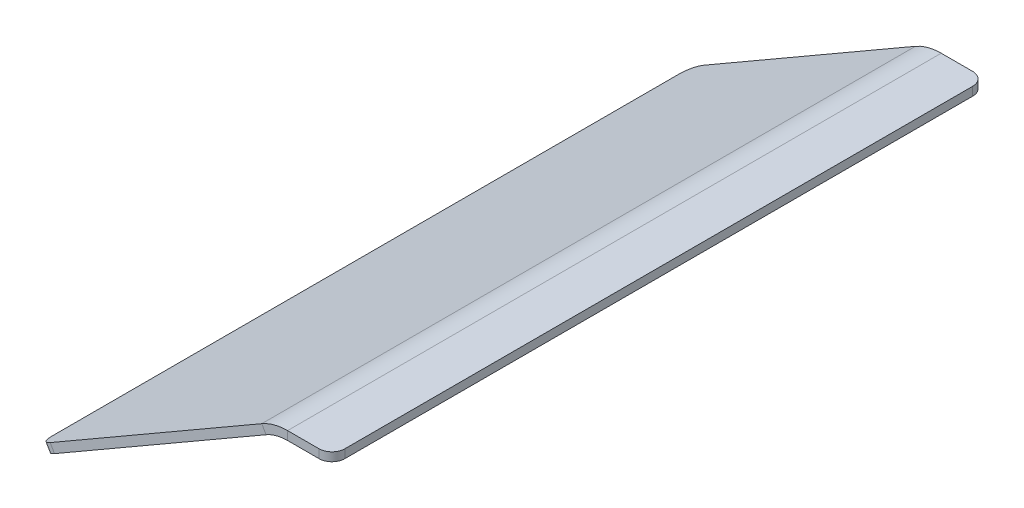
ISO-10303-21;
HEADER;
FILE_DESCRIPTION(('STEP AP214'),'2;1');
FILE_NAME('part.step','',(''),(''),'','','');
FILE_SCHEMA(('AUTOMOTIVE_DESIGN { 1 0 10303 214 1 1 1 1 }'));
ENDSEC;
DATA;
#1=APPLICATION_CONTEXT('core data for automotive mechanical design processes');
#2=APPLICATION_PROTOCOL_DEFINITION('international standard','automotive_design',2000,#1);
#3=PRODUCT_CONTEXT('',#1,'mechanical');
#4=PRODUCT('Part','Part','',(#3));
#5=PRODUCT_RELATED_PRODUCT_CATEGORY('part','',(#4));
#6=PRODUCT_DEFINITION_FORMATION('','',#4);
#7=PRODUCT_DEFINITION_CONTEXT('part definition',#1,'design');
#8=PRODUCT_DEFINITION('design','',#6,#7);
#9=PRODUCT_DEFINITION_SHAPE('','',#8);
#10=(LENGTH_UNIT() NAMED_UNIT(*) SI_UNIT(.MILLI.,.METRE.));
#11=(NAMED_UNIT(*) PLANE_ANGLE_UNIT() SI_UNIT($,.RADIAN.));
#12=(NAMED_UNIT(*) SI_UNIT($,.STERADIAN.) SOLID_ANGLE_UNIT());
#13=UNCERTAINTY_MEASURE_WITH_UNIT(LENGTH_MEASURE(1.E-05),#10,'distance_accuracy_value','');
#14=(GEOMETRIC_REPRESENTATION_CONTEXT(3) GLOBAL_UNCERTAINTY_ASSIGNED_CONTEXT((#13)) GLOBAL_UNIT_ASSIGNED_CONTEXT((#10,
#11,#12)) REPRESENTATION_CONTEXT('',''));
#15=CARTESIAN_POINT('',(0.,0.,0.));
#16=DIRECTION('',(0.,0.,1.));
#17=DIRECTION('',(1.,0.,0.));
#18=AXIS2_PLACEMENT_3D('',#15,#16,#17);
#19=CARTESIAN_POINT('',(-3.32050807568874,0.392304845413293,0.));
#20=DIRECTION('',(0.,0.,-1.));
#21=DIRECTION('',(-1.,0.,0.));
#22=AXIS2_PLACEMENT_3D('',#19,#20,#21);
#23=PLANE('',#22);
#24=DIRECTION('',(1.,0.,0.));
#25=VECTOR('',#24,1.);
#26=CARTESIAN_POINT('',(2.67949192431119,2.,0.));
#27=LINE('',#26,#25);
#28=CARTESIAN_POINT('',(10.,2.,0.));
#29=VERTEX_POINT('',#28);
#30=CARTESIAN_POINT('',(2.67949192431119,2.,0.));
#31=VERTEX_POINT('',#30);
#32=EDGE_CURVE('E167',#29,#31,#27,.F.);
#33=ORIENTED_EDGE('',*,*,#32,.F.);
#34=DIRECTION('',(0.,-1.,0.));
#35=VECTOR('',#34,1.);
#36=CARTESIAN_POINT('',(10.,0.392304845413294,0.));
#37=LINE('',#36,#35);
#38=CARTESIAN_POINT('',(10.,0.,0.));
#39=VERTEX_POINT('',#38);
#40=EDGE_CURVE('E186',#29,#39,#37,.T.);
#41=ORIENTED_EDGE('',*,*,#40,.T.);
#42=DIRECTION('',(-1.,0.,0.));
#43=VECTOR('',#42,1.);
#44=CARTESIAN_POINT('',(2.67949192431119,0.,0.));
#45=LINE('',#44,#43);
#46=CARTESIAN_POINT('',(2.67949192431119,0.,0.));
#47=VERTEX_POINT('',#46);
#48=EDGE_CURVE('E195',#39,#47,#45,.T.);
#49=ORIENTED_EDGE('',*,*,#48,.T.);
#50=DIRECTION('',(0.,1.,0.));
#51=VECTOR('',#50,1.);
#52=CARTESIAN_POINT('',(2.67949192431119,0.,0.));
#53=LINE('',#52,#51);
#54=EDGE_CURVE('E13',#47,#31,#53,.T.);
#55=ORIENTED_EDGE('',*,*,#54,.T.);
#56=EDGE_LOOP('',(#33,#41,#49,#55));
#57=FACE_BOUND('',#56,.T.);
#58=ADVANCED_FACE('F48',(#57),#23,.T.);
#59=CARTESIAN_POINT('',(2.67949192431119,0.,152.));
#60=DIRECTION('',(0.,-1.,0.));
#61=DIRECTION('',(0.,0.,-1.));
#62=AXIS2_PLACEMENT_3D('',#59,#60,#61);
#63=PLANE('',#62);
#64=DIRECTION('',(0.,0.,-1.));
#65=VECTOR('',#64,1.);
#66=CARTESIAN_POINT('',(13.,0.,152.));
#67=LINE('',#66,#65);
#68=CARTESIAN_POINT('',(13.,0.,149.));
#69=VERTEX_POINT('',#68);
#70=CARTESIAN_POINT('',(13.,0.,3.));
#71=VERTEX_POINT('',#70);
#72=EDGE_CURVE('E189',#69,#71,#67,.T.);
#73=ORIENTED_EDGE('',*,*,#72,.F.);
#74=CARTESIAN_POINT('',(10.,0.,149.));
#75=DIRECTION('',(0.,-1.,0.));
#76=DIRECTION('',(0.,0.,-1.));
#77=AXIS2_PLACEMENT_3D('',#74,#75,#76);
#78=CIRCLE('',#77,3.);
#79=CARTESIAN_POINT('',(10.,0.,152.));
#80=VERTEX_POINT('',#79);
#81=EDGE_CURVE('E165',#69,#80,#78,.T.);
#82=ORIENTED_EDGE('',*,*,#81,.T.);
#83=DIRECTION('',(-1.,0.,0.));
#84=VECTOR('',#83,1.);
#85=CARTESIAN_POINT('',(2.67949192431119,0.,152.));
#86=LINE('',#85,#84);
#87=CARTESIAN_POINT('',(2.6794919243112,0.,152.));
#88=VERTEX_POINT('',#87);
#89=EDGE_CURVE('E162',#80,#88,#86,.T.);
#90=ORIENTED_EDGE('',*,*,#89,.T.);
#91=DIRECTION('',(0.,0.,-1.));
#92=VECTOR('',#91,1.);
#93=CARTESIAN_POINT('',(2.67949192431119,0.,152.));
#94=LINE('',#93,#92);
#95=EDGE_CURVE('E153',#88,#47,#94,.T.);
#96=ORIENTED_EDGE('',*,*,#95,.T.);
#97=ORIENTED_EDGE('',*,*,#48,.F.);
#98=CARTESIAN_POINT('',(10.,0.,3.));
#99=DIRECTION('',(0.,-1.,0.));
#100=DIRECTION('',(0.,0.,-1.));
#101=AXIS2_PLACEMENT_3D('',#98,#99,#100);
#102=CIRCLE('',#101,3.);
#103=EDGE_CURVE('E183',#39,#71,#102,.T.);
#104=ORIENTED_EDGE('',*,*,#103,.T.);
#105=EDGE_LOOP('',(#73,#82,#90,#96,#97,#104));
#106=FACE_BOUND('',#105,.T.);
#107=ADVANCED_FACE('F164',(#106),#63,.T.);
#108=CARTESIAN_POINT('',(13.,2.,152.));
#109=DIRECTION('',(1.,0.,0.));
#110=DIRECTION('',(0.,0.,-1.));
#111=AXIS2_PLACEMENT_3D('',#108,#109,#110);
#112=PLANE('',#111);
#113=DIRECTION('',(0.,0.,-1.));
#114=VECTOR('',#113,1.);
#115=CARTESIAN_POINT('',(13.,2.,152.));
#116=LINE('',#115,#114);
#117=CARTESIAN_POINT('',(13.,2.,149.));
#118=VERTEX_POINT('',#117);
#119=CARTESIAN_POINT('',(13.,2.,3.));
#120=VERTEX_POINT('',#119);
#121=EDGE_CURVE('E191',#118,#120,#116,.T.);
#122=ORIENTED_EDGE('',*,*,#121,.F.);
#123=DIRECTION('',(0.,-1.,0.));
#124=VECTOR('',#123,1.);
#125=CARTESIAN_POINT('',(13.,2.,149.));
#126=LINE('',#125,#124);
#127=EDGE_CURVE('E175',#118,#69,#126,.T.);
#128=ORIENTED_EDGE('',*,*,#127,.T.);
#129=ORIENTED_EDGE('',*,*,#72,.T.);
#130=DIRECTION('',(0.,-1.,0.));
#131=VECTOR('',#130,1.);
#132=CARTESIAN_POINT('',(13.,2.,3.));
#133=LINE('',#132,#131);
#134=EDGE_CURVE('E180',#71,#120,#133,.F.);
#135=ORIENTED_EDGE('',*,*,#134,.T.);
#136=EDGE_LOOP('',(#122,#128,#129,#135));
#137=FACE_BOUND('',#136,.T.);
#138=ADVANCED_FACE('F261',(#137),#112,.T.);
#139=CARTESIAN_POINT('',(2.67949192431119,2.,152.));
#140=DIRECTION('',(0.,-1.,0.));
#141=DIRECTION('',(0.,0.,-1.));
#142=AXIS2_PLACEMENT_3D('',#139,#140,#141);
#143=PLANE('',#142);
#144=DIRECTION('',(1.,0.,0.));
#145=VECTOR('',#144,1.);
#146=CARTESIAN_POINT('',(2.67949192431119,2.,152.));
#147=LINE('',#146,#145);
#148=CARTESIAN_POINT('',(10.,2.,152.));
#149=VERTEX_POINT('',#148);
#150=CARTESIAN_POINT('',(2.6794919243112,2.,152.));
#151=VERTEX_POINT('',#150);
#152=EDGE_CURVE('E166',#149,#151,#147,.F.);
#153=ORIENTED_EDGE('',*,*,#152,.F.);
#154=CARTESIAN_POINT('',(10.,2.,149.));
#155=DIRECTION('',(0.,-1.,0.));
#156=DIRECTION('',(0.,0.,-1.));
#157=AXIS2_PLACEMENT_3D('',#154,#155,#156);
#158=CIRCLE('',#157,3.);
#159=EDGE_CURVE('E160',#149,#118,#158,.F.);
#160=ORIENTED_EDGE('',*,*,#159,.T.);
#161=ORIENTED_EDGE('',*,*,#121,.T.);
#162=CARTESIAN_POINT('',(10.,2.,3.));
#163=DIRECTION('',(0.,-1.,0.));
#164=DIRECTION('',(0.,0.,-1.));
#165=AXIS2_PLACEMENT_3D('',#162,#163,#164);
#166=CIRCLE('',#165,3.);
#167=EDGE_CURVE('E178',#120,#29,#166,.F.);
#168=ORIENTED_EDGE('',*,*,#167,.T.);
#169=ORIENTED_EDGE('',*,*,#32,.T.);
#170=DIRECTION('',(0.,0.,-1.));
#171=VECTOR('',#170,1.);
#172=CARTESIAN_POINT('',(2.67949192431119,1.99999999999999,152.));
#173=LINE('',#172,#171);
#174=EDGE_CURVE('E56',#151,#31,#173,.T.);
#175=ORIENTED_EDGE('',*,*,#174,.F.);
#176=EDGE_LOOP('',(#153,#160,#161,#168,#169,#175));
#177=FACE_BOUND('',#176,.T.);
#178=ADVANCED_FACE('F252',(#177),#143,.F.);
#179=CARTESIAN_POINT('',(2.67949192431119,-10.,152.));
#180=DIRECTION('',(0.,0.,1.));
#181=DIRECTION('',(1.,0.,0.));
#182=AXIS2_PLACEMENT_3D('',#179,#180,#181);
#183=PLANE('',#182);
#184=ORIENTED_EDGE('',*,*,#89,.F.);
#185=DIRECTION('',(0.,-1.,0.));
#186=VECTOR('',#185,1.);
#187=CARTESIAN_POINT('',(10.,-10.,152.));
#188=LINE('',#187,#186);
#189=EDGE_CURVE('E70',#80,#149,#188,.F.);
#190=ORIENTED_EDGE('',*,*,#189,.T.);
#191=ORIENTED_EDGE('',*,*,#152,.T.);
#192=DIRECTION('',(0.,-1.,0.));
#193=VECTOR('',#192,1.);
#194=CARTESIAN_POINT('',(2.67949192431119,1.99999999999999,152.));
#195=LINE('',#194,#193);
#196=EDGE_CURVE('E143',#151,#88,#195,.T.);
#197=ORIENTED_EDGE('',*,*,#196,.T.);
#198=EDGE_LOOP('',(#184,#190,#191,#197));
#199=FACE_BOUND('',#198,.T.);
#200=ADVANCED_FACE('F169',(#199),#183,.T.);
#201=CARTESIAN_POINT('',(10.,0.392304845413294,3.));
#202=DIRECTION('',(0.,-1.,0.));
#203=DIRECTION('',(0.,0.,-1.));
#204=AXIS2_PLACEMENT_3D('',#201,#202,#203);
#205=CYLINDRICAL_SURFACE('',#204,3.);
#206=ORIENTED_EDGE('',*,*,#167,.F.);
#207=ORIENTED_EDGE('',*,*,#134,.F.);
#208=ORIENTED_EDGE('',*,*,#103,.F.);
#209=ORIENTED_EDGE('',*,*,#40,.F.);
#210=EDGE_LOOP('',(#206,#207,#208,#209));
#211=FACE_BOUND('',#210,.T.);
#212=ADVANCED_FACE('F258',(#211),#205,.T.);
#213=CARTESIAN_POINT('',(10.,2.,149.));
#214=DIRECTION('',(0.,-1.,0.));
#215=DIRECTION('',(0.,0.,-1.));
#216=AXIS2_PLACEMENT_3D('',#213,#214,#215);
#217=CYLINDRICAL_SURFACE('',#216,3.);
#218=ORIENTED_EDGE('',*,*,#159,.F.);
#219=ORIENTED_EDGE('',*,*,#189,.F.);
#220=ORIENTED_EDGE('',*,*,#81,.F.);
#221=ORIENTED_EDGE('',*,*,#127,.F.);
#222=EDGE_LOOP('',(#218,#219,#220,#221));
#223=FACE_BOUND('',#222,.T.);
#224=ADVANCED_FACE('F50',(#223),#217,.T.);
#225=CARTESIAN_POINT('',(-51.5285115251743,-29.7499999999997,149.));
#226=DIRECTION('',(-0.499999999999999,0.866025403784439,0.));
#227=DIRECTION('',(-0.866025403784439,-0.499999999999999,0.));
#228=AXIS2_PLACEMENT_3D('',#225,#226,#227);
#229=CYLINDRICAL_SURFACE('',#228,3.);
#230=CARTESIAN_POINT('',(-51.5285115251743,-29.7499999999997,149.));
#231=DIRECTION('',(0.499999999999995,-0.866025403784442,0.));
#232=DIRECTION('',(0.866025403784442,0.499999999999995,0.));
#233=AXIS2_PLACEMENT_3D('',#230,#231,#232);
#234=CIRCLE('',#233,3.);
#235=CARTESIAN_POINT('',(-51.5285115251743,-29.7499999999997,152.));
#236=VERTEX_POINT('',#235);
#237=CARTESIAN_POINT('',(-54.1265877365276,-31.2499999999997,149.));
#238=VERTEX_POINT('',#237);
#239=EDGE_CURVE('E217',#236,#238,#234,.T.);
#240=ORIENTED_EDGE('',*,*,#239,.F.);
#241=DIRECTION('',(-0.499999999999999,0.866025403784439,0.));
#242=VECTOR('',#241,1.);
#243=CARTESIAN_POINT('',(-51.7246639478808,-29.4102540378443,152.));
#244=LINE('',#243,#242);
#245=CARTESIAN_POINT('',(-52.5285115251743,-28.0179491924308,152.));
#246=VERTEX_POINT('',#245);
#247=EDGE_CURVE('E222',#246,#236,#244,.F.);
#248=ORIENTED_EDGE('',*,*,#247,.F.);
#249=CARTESIAN_POINT('',(-52.5285115251743,-28.0179491924308,149.));
#250=DIRECTION('',(0.499999999999995,-0.866025403784442,0.));
#251=DIRECTION('',(0.866025403784442,0.499999999999995,0.));
#252=AXIS2_PLACEMENT_3D('',#249,#250,#251);
#253=CIRCLE('',#252,3.);
#254=CARTESIAN_POINT('',(-55.1265877365276,-29.5179491924308,149.));
#255=VERTEX_POINT('',#254);
#256=EDGE_CURVE('E230',#255,#246,#253,.F.);
#257=ORIENTED_EDGE('',*,*,#256,.F.);
#258=DIRECTION('',(-0.499999999999999,0.866025403784439,0.));
#259=VECTOR('',#258,1.);
#260=CARTESIAN_POINT('',(-54.1265877365276,-31.2499999999997,149.));
#261=LINE('',#260,#259);
#262=EDGE_CURVE('E206',#238,#255,#261,.T.);
#263=ORIENTED_EDGE('',*,*,#262,.F.);
#264=EDGE_LOOP('',(#240,#248,#257,#263));
#265=FACE_BOUND('',#264,.T.);
#266=ADVANCED_FACE('F266',(#265),#229,.T.);
#267=CARTESIAN_POINT('',(-46.5285115251741,-38.4102540378443,3.));
#268=DIRECTION('',(0.499999999999999,-0.866025403784439,0.));
#269=DIRECTION('',(0.866025403784439,0.499999999999999,0.));
#270=AXIS2_PLACEMENT_3D('',#267,#268,#269);
#271=CYLINDRICAL_SURFACE('',#270,3.);
#272=CARTESIAN_POINT('',(-51.5285115251743,-29.7499999999997,3.));
#273=DIRECTION('',(0.499999999999995,-0.866025403784442,0.));
#274=DIRECTION('',(0.866025403784442,0.499999999999995,0.));
#275=AXIS2_PLACEMENT_3D('',#272,#273,#274);
#276=CIRCLE('',#275,3.);
#277=CARTESIAN_POINT('',(-54.1265877365276,-31.2499999999997,3.));
#278=VERTEX_POINT('',#277);
#279=CARTESIAN_POINT('',(-51.5285115251743,-29.7499999999997,0.));
#280=VERTEX_POINT('',#279);
#281=EDGE_CURVE('E212',#278,#280,#276,.T.);
#282=ORIENTED_EDGE('',*,*,#281,.F.);
#283=DIRECTION('',(-0.499999999999999,0.866025403784439,0.));
#284=VECTOR('',#283,1.);
#285=CARTESIAN_POINT('',(-54.1265877365276,-31.2499999999997,3.));
#286=LINE('',#285,#284);
#287=CARTESIAN_POINT('',(-55.1265877365276,-29.5179491924308,3.));
#288=VERTEX_POINT('',#287);
#289=EDGE_CURVE('E204',#288,#278,#286,.F.);
#290=ORIENTED_EDGE('',*,*,#289,.F.);
#291=CARTESIAN_POINT('',(-52.5285115251743,-28.0179491924308,3.));
#292=DIRECTION('',(0.499999999999995,-0.866025403784442,0.));
#293=DIRECTION('',(0.866025403784442,0.499999999999995,0.));
#294=AXIS2_PLACEMENT_3D('',#291,#292,#293);
#295=CIRCLE('',#294,3.);
#296=CARTESIAN_POINT('',(-52.5285115251743,-28.0179491924308,0.));
#297=VERTEX_POINT('',#296);
#298=EDGE_CURVE('E228',#297,#288,#295,.F.);
#299=ORIENTED_EDGE('',*,*,#298,.F.);
#300=DIRECTION('',(-0.499999999999999,0.866025403784439,0.));
#301=VECTOR('',#300,1.);
#302=CARTESIAN_POINT('',(-52.5285115251743,-28.0179491924308,0.));
#303=LINE('',#302,#301);
#304=EDGE_CURVE('E238',#280,#297,#303,.T.);
#305=ORIENTED_EDGE('',*,*,#304,.F.);
#306=EDGE_LOOP('',(#282,#290,#299,#305));
#307=FACE_BOUND('',#306,.T.);
#308=ADVANCED_FACE('F271',(#307),#271,.T.);
#309=CARTESIAN_POINT('',(-54.1265877365276,-31.2499999999997,152.));
#310=DIRECTION('',(-0.866025403784439,-0.499999999999999,0.));
#311=DIRECTION('',(0.499999999999999,-0.866025403784439,0.));
#312=AXIS2_PLACEMENT_3D('',#309,#310,#311);
#313=PLANE('',#312);
#314=DIRECTION('',(0.,0.,-1.));
#315=VECTOR('',#314,1.);
#316=CARTESIAN_POINT('',(-55.1265877365276,-29.5179491924308,152.));
#317=LINE('',#316,#315);
#318=EDGE_CURVE('E201',#255,#288,#317,.T.);
#319=ORIENTED_EDGE('',*,*,#318,.T.);
#320=ORIENTED_EDGE('',*,*,#289,.T.);
#321=DIRECTION('',(0.,0.,-1.));
#322=VECTOR('',#321,1.);
#323=CARTESIAN_POINT('',(-54.1265877365276,-31.2499999999997,152.));
#324=LINE('',#323,#322);
#325=EDGE_CURVE('E209',#238,#278,#324,.T.);
#326=ORIENTED_EDGE('',*,*,#325,.F.);
#327=ORIENTED_EDGE('',*,*,#262,.T.);
#328=EDGE_LOOP('',(#319,#320,#326,#327));
#329=FACE_BOUND('',#328,.T.);
#330=ADVANCED_FACE('F302',(#329),#313,.T.);
#331=CARTESIAN_POINT('',(-2.32050807568875,-1.33974596215559,152.));
#332=DIRECTION('',(0.499999999999995,-0.866025403784442,0.));
#333=DIRECTION('',(0.866025403784442,0.499999999999995,0.));
#334=AXIS2_PLACEMENT_3D('',#331,#332,#333);
#335=PLANE('',#334);
#336=ORIENTED_EDGE('',*,*,#325,.T.);
#337=ORIENTED_EDGE('',*,*,#281,.T.);
#338=DIRECTION('',(-0.866025403784442,-0.499999999999995,0.));
#339=VECTOR('',#338,1.);
#340=CARTESIAN_POINT('',(-2.32050807568875,-1.33974596215559,0.));
#341=LINE('',#340,#339);
#342=CARTESIAN_POINT('',(-2.32050807568875,-1.33974596215559,0.));
#343=VERTEX_POINT('',#342);
#344=EDGE_CURVE('E235',#343,#280,#341,.T.);
#345=ORIENTED_EDGE('',*,*,#344,.F.);
#346=DIRECTION('',(0.,0.,-1.));
#347=VECTOR('',#346,1.);
#348=CARTESIAN_POINT('',(-2.32050807568875,-1.33974596215559,152.));
#349=LINE('',#348,#347);
#350=CARTESIAN_POINT('',(-2.32050807568875,-1.33974596215559,152.));
#351=VERTEX_POINT('',#350);
#352=EDGE_CURVE('E199',#351,#343,#349,.T.);
#353=ORIENTED_EDGE('',*,*,#352,.F.);
#354=DIRECTION('',(-0.866025403784442,-0.499999999999995,0.));
#355=VECTOR('',#354,1.);
#356=CARTESIAN_POINT('',(-2.32050807568875,-1.33974596215559,152.));
#357=LINE('',#356,#355);
#358=EDGE_CURVE('E214',#351,#236,#357,.T.);
#359=ORIENTED_EDGE('',*,*,#358,.T.);
#360=ORIENTED_EDGE('',*,*,#239,.T.);
#361=EDGE_LOOP('',(#336,#337,#345,#353,#359,#360));
#362=FACE_BOUND('',#361,.T.);
#363=ADVANCED_FACE('F298',(#362),#335,.T.);
#364=CARTESIAN_POINT('',(2.67949192431119,2.,152.));
#365=DIRECTION('',(0.,0.,1.));
#366=DIRECTION('',(1.,0.,0.));
#367=AXIS2_PLACEMENT_3D('',#364,#365,#366);
#368=PLANE('',#367);
#369=DIRECTION('',(-0.866025403784442,-0.499999999999995,0.));
#370=VECTOR('',#369,1.);
#371=CARTESIAN_POINT('',(-3.32050807568874,0.392304845413296,152.));
#372=LINE('',#371,#370);
#373=CARTESIAN_POINT('',(-3.32050807568874,0.392304845413296,152.));
#374=VERTEX_POINT('',#373);
#375=EDGE_CURVE('E219',#374,#246,#372,.T.);
#376=ORIENTED_EDGE('',*,*,#375,.T.);
#377=ORIENTED_EDGE('',*,*,#247,.T.);
#378=ORIENTED_EDGE('',*,*,#358,.F.);
#379=DIRECTION('',(-0.499999999999995,0.866025403784441,0.));
#380=VECTOR('',#379,1.);
#381=CARTESIAN_POINT('',(-2.32050807568875,-1.33974596215559,152.));
#382=LINE('',#381,#380);
#383=EDGE_CURVE('E145',#351,#374,#382,.T.);
#384=ORIENTED_EDGE('',*,*,#383,.T.);
#385=EDGE_LOOP('',(#376,#377,#378,#384));
#386=FACE_BOUND('',#385,.T.);
#387=ADVANCED_FACE('F294',(#386),#368,.T.);
#388=CARTESIAN_POINT('',(-3.32050807568874,0.392304845413296,152.));
#389=DIRECTION('',(0.499999999999995,-0.866025403784442,0.));
#390=DIRECTION('',(0.866025403784442,0.499999999999995,0.));
#391=AXIS2_PLACEMENT_3D('',#388,#389,#390);
#392=PLANE('',#391);
#393=DIRECTION('',(-0.866025403784442,-0.499999999999995,0.));
#394=VECTOR('',#393,1.);
#395=CARTESIAN_POINT('',(-3.32050807568874,0.392304845413296,0.));
#396=LINE('',#395,#394);
#397=CARTESIAN_POINT('',(-3.32050807568874,0.392304845413296,0.));
#398=VERTEX_POINT('',#397);
#399=EDGE_CURVE('E225',#398,#297,#396,.T.);
#400=ORIENTED_EDGE('',*,*,#399,.T.);
#401=ORIENTED_EDGE('',*,*,#298,.T.);
#402=ORIENTED_EDGE('',*,*,#318,.F.);
#403=ORIENTED_EDGE('',*,*,#256,.T.);
#404=ORIENTED_EDGE('',*,*,#375,.F.);
#405=DIRECTION('',(0.,0.,-1.));
#406=VECTOR('',#405,1.);
#407=CARTESIAN_POINT('',(-3.32050807568874,0.392304845413296,152.));
#408=LINE('',#407,#406);
#409=EDGE_CURVE('E232',#374,#398,#408,.T.);
#410=ORIENTED_EDGE('',*,*,#409,.T.);
#411=EDGE_LOOP('',(#400,#401,#402,#403,#404,#410));
#412=FACE_BOUND('',#411,.T.);
#413=ADVANCED_FACE('F290',(#412),#392,.F.);
#414=CARTESIAN_POINT('',(2.67949192431119,-10.,0.));
#415=DIRECTION('',(0.,0.,1.));
#416=DIRECTION('',(1.,0.,0.));
#417=AXIS2_PLACEMENT_3D('',#414,#415,#416);
#418=PLANE('',#417);
#419=ORIENTED_EDGE('',*,*,#344,.T.);
#420=ORIENTED_EDGE('',*,*,#304,.T.);
#421=ORIENTED_EDGE('',*,*,#399,.F.);
#422=DIRECTION('',(0.499999999999995,-0.866025403784441,0.));
#423=VECTOR('',#422,1.);
#424=CARTESIAN_POINT('',(-3.32050807568874,0.392304845413296,0.));
#425=LINE('',#424,#423);
#426=EDGE_CURVE('E197',#398,#343,#425,.T.);
#427=ORIENTED_EDGE('',*,*,#426,.T.);
#428=EDGE_LOOP('',(#419,#420,#421,#427));
#429=FACE_BOUND('',#428,.T.);
#430=ADVANCED_FACE('F287',(#429),#418,.F.);
#431=CARTESIAN_POINT('',(2.6794919243112,-10.,152.));
#432=DIRECTION('',(0.,0.,-1.));
#433=DIRECTION('',(-1.,0.,0.));
#434=AXIS2_PLACEMENT_3D('',#431,#432,#433);
#435=PLANE('',#434);
#436=ORIENTED_EDGE('',*,*,#196,.F.);
#437=CARTESIAN_POINT('',(2.6794919243112,-10.,152.));
#438=DIRECTION('',(0.,0.,1.));
#439=DIRECTION('',(1.,0.,0.));
#440=AXIS2_PLACEMENT_3D('',#437,#438,#439);
#441=CIRCLE('',#440,12.);
#442=EDGE_CURVE('E243',#151,#374,#441,.T.);
#443=ORIENTED_EDGE('',*,*,#442,.T.);
#444=ORIENTED_EDGE('',*,*,#383,.F.);
#445=CARTESIAN_POINT('',(2.6794919243112,-10.,152.));
#446=DIRECTION('',(0.,0.,1.));
#447=DIRECTION('',(1.,0.,0.));
#448=AXIS2_PLACEMENT_3D('',#445,#446,#447);
#449=CIRCLE('',#448,10.);
#450=EDGE_CURVE('E139',#88,#351,#449,.T.);
#451=ORIENTED_EDGE('',*,*,#450,.F.);
#452=EDGE_LOOP('',(#436,#443,#444,#451));
#453=FACE_BOUND('',#452,.T.);
#454=ADVANCED_FACE('F141',(#453),#435,.F.);
#455=CARTESIAN_POINT('',(2.6794919243112,-10.,0.));
#456=DIRECTION('',(0.,0.,1.));
#457=DIRECTION('',(1.,0.,0.));
#458=AXIS2_PLACEMENT_3D('',#455,#456,#457);
#459=PLANE('',#458);
#460=ORIENTED_EDGE('',*,*,#426,.F.);
#461=CARTESIAN_POINT('',(2.6794919243112,-10.,0.));
#462=DIRECTION('',(0.,0.,1.));
#463=DIRECTION('',(1.,0.,0.));
#464=AXIS2_PLACEMENT_3D('',#461,#462,#463);
#465=CIRCLE('',#464,12.);
#466=EDGE_CURVE('E149',#398,#31,#465,.F.);
#467=ORIENTED_EDGE('',*,*,#466,.T.);
#468=ORIENTED_EDGE('',*,*,#54,.F.);
#469=CARTESIAN_POINT('',(2.6794919243112,-10.,0.));
#470=DIRECTION('',(0.,0.,-1.));
#471=DIRECTION('',(-1.,0.,0.));
#472=AXIS2_PLACEMENT_3D('',#469,#470,#471);
#473=CIRCLE('',#472,10.);
#474=EDGE_CURVE('E148',#343,#47,#473,.T.);
#475=ORIENTED_EDGE('',*,*,#474,.F.);
#476=EDGE_LOOP('',(#460,#467,#468,#475));
#477=FACE_BOUND('',#476,.T.);
#478=ADVANCED_FACE('F247',(#477),#459,.F.);
#479=CARTESIAN_POINT('',(2.6794919243112,-10.,-76.1877939587185));
#480=DIRECTION('',(0.,0.,1.));
#481=DIRECTION('',(1.,0.,0.));
#482=AXIS2_PLACEMENT_3D('',#479,#480,#481);
#483=CYLINDRICAL_SURFACE('',#482,10.);
#484=ORIENTED_EDGE('',*,*,#474,.T.);
#485=ORIENTED_EDGE('',*,*,#95,.F.);
#486=ORIENTED_EDGE('',*,*,#450,.T.);
#487=ORIENTED_EDGE('',*,*,#352,.T.);
#488=EDGE_LOOP('',(#484,#485,#486,#487));
#489=FACE_BOUND('',#488,.T.);
#490=ADVANCED_FACE('F155',(#489),#483,.F.);
#491=CARTESIAN_POINT('',(2.6794919243112,-10.,-76.1877939587185));
#492=DIRECTION('',(0.,0.,1.));
#493=DIRECTION('',(1.,0.,0.));
#494=AXIS2_PLACEMENT_3D('',#491,#492,#493);
#495=CYLINDRICAL_SURFACE('',#494,12.);
#496=ORIENTED_EDGE('',*,*,#466,.F.);
#497=ORIENTED_EDGE('',*,*,#409,.F.);
#498=ORIENTED_EDGE('',*,*,#442,.F.);
#499=ORIENTED_EDGE('',*,*,#174,.T.);
#500=EDGE_LOOP('',(#496,#497,#498,#499));
#501=FACE_BOUND('',#500,.T.);
#502=ADVANCED_FACE('F314',(#501),#495,.T.);
#503=CLOSED_SHELL('',(#58,#107,#138,#178,#200,#212,#224,#266,#308,#330,#363,#387,#413,#430,#454,
#478,#490,#502));
#504=MANIFOLD_SOLID_BREP('B2',#503);
#505=ADVANCED_BREP_SHAPE_REPRESENTATION('',(#18,#504),#14);
#506=SHAPE_DEFINITION_REPRESENTATION(#9,#505);
ENDSEC;
END-ISO-10303-21;
